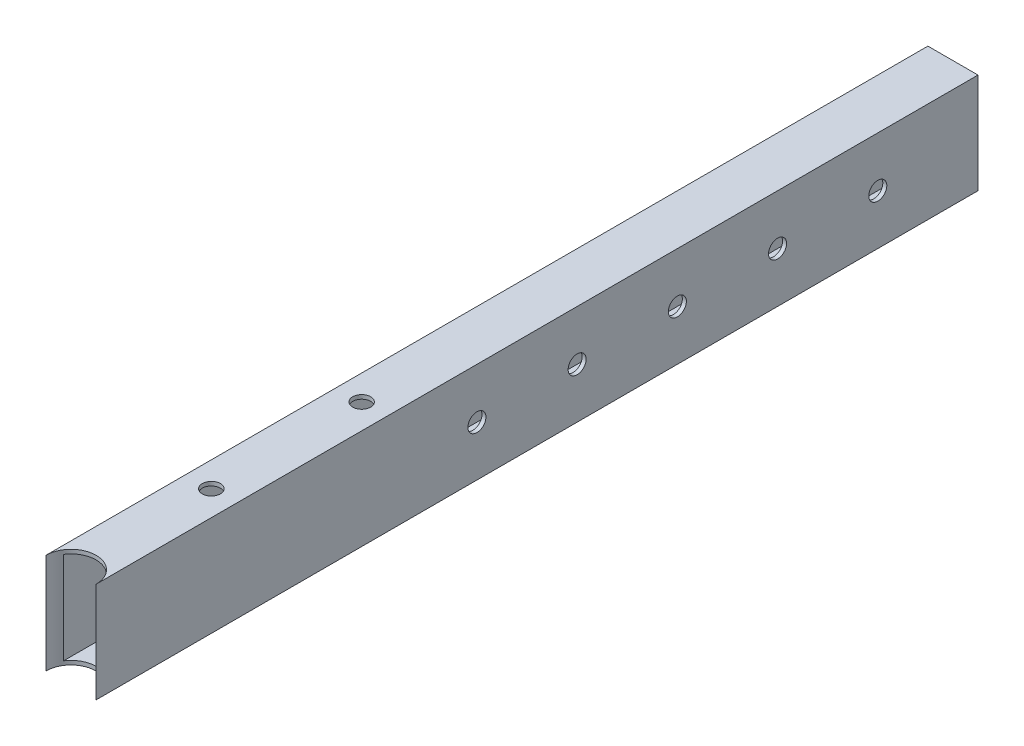
ISO-10303-21;
HEADER;
FILE_DESCRIPTION(('STEP AP214'),'2;1');
FILE_NAME('part.step','',(''),(''),'','','');
FILE_SCHEMA(('AUTOMOTIVE_DESIGN { 1 0 10303 214 1 1 1 1 }'));
ENDSEC;
DATA;
#1=APPLICATION_CONTEXT('core data for automotive mechanical design processes');
#2=APPLICATION_PROTOCOL_DEFINITION('international standard','automotive_design',2000,#1);
#3=PRODUCT_CONTEXT('',#1,'mechanical');
#4=PRODUCT('Part','Part','',(#3));
#5=PRODUCT_RELATED_PRODUCT_CATEGORY('part','',(#4));
#6=PRODUCT_DEFINITION_FORMATION('','',#4);
#7=PRODUCT_DEFINITION_CONTEXT('part definition',#1,'design');
#8=PRODUCT_DEFINITION('design','',#6,#7);
#9=PRODUCT_DEFINITION_SHAPE('','',#8);
#10=(LENGTH_UNIT() NAMED_UNIT(*) SI_UNIT(.MILLI.,.METRE.));
#11=(NAMED_UNIT(*) PLANE_ANGLE_UNIT() SI_UNIT($,.RADIAN.));
#12=(NAMED_UNIT(*) SI_UNIT($,.STERADIAN.) SOLID_ANGLE_UNIT());
#13=UNCERTAINTY_MEASURE_WITH_UNIT(LENGTH_MEASURE(1.E-05),#10,'distance_accuracy_value','');
#14=(GEOMETRIC_REPRESENTATION_CONTEXT(3) GLOBAL_UNCERTAINTY_ASSIGNED_CONTEXT((#13)) GLOBAL_UNIT_ASSIGNED_CONTEXT((#10,
#11,#12)) REPRESENTATION_CONTEXT('',''));
#15=CARTESIAN_POINT('',(0.,0.,0.));
#16=DIRECTION('',(0.,0.,1.));
#17=DIRECTION('',(1.,0.,0.));
#18=AXIS2_PLACEMENT_3D('',#15,#16,#17);
#19=CARTESIAN_POINT('',(0.,0.,0.));
#20=DIRECTION('',(0.,0.,1.));
#21=DIRECTION('',(1.,0.,0.));
#22=AXIS2_PLACEMENT_3D('',#19,#20,#21);
#23=PLANE('',#22);
#24=DIRECTION('',(0.,1.,0.));
#25=VECTOR('',#24,1.);
#26=CARTESIAN_POINT('',(12.5,25.,0.));
#27=LINE('',#26,#25);
#28=CARTESIAN_POINT('',(12.5,-25.,0.));
#29=VERTEX_POINT('',#28);
#30=CARTESIAN_POINT('',(12.5,25.,0.));
#31=VERTEX_POINT('',#30);
#32=EDGE_CURVE('E134',#29,#31,#27,.T.);
#33=ORIENTED_EDGE('',*,*,#32,.F.);
#34=DIRECTION('',(1.,0.,0.));
#35=VECTOR('',#34,1.);
#36=CARTESIAN_POINT('',(-12.5,-25.,0.));
#37=LINE('',#36,#35);
#38=CARTESIAN_POINT('',(-12.5,-25.,0.));
#39=VERTEX_POINT('',#38);
#40=EDGE_CURVE('E118',#39,#29,#37,.T.);
#41=ORIENTED_EDGE('',*,*,#40,.F.);
#42=DIRECTION('',(0.,-1.,0.));
#43=VECTOR('',#42,1.);
#44=CARTESIAN_POINT('',(-12.5,25.,0.));
#45=LINE('',#44,#43);
#46=CARTESIAN_POINT('',(-12.5,25.,0.));
#47=VERTEX_POINT('',#46);
#48=EDGE_CURVE('E128',#47,#39,#45,.T.);
#49=ORIENTED_EDGE('',*,*,#48,.F.);
#50=DIRECTION('',(-1.,0.,0.));
#51=VECTOR('',#50,1.);
#52=CARTESIAN_POINT('',(-12.5,25.,0.));
#53=LINE('',#52,#51);
#54=EDGE_CURVE('E136',#31,#47,#53,.T.);
#55=ORIENTED_EDGE('',*,*,#54,.F.);
#56=EDGE_LOOP('',(#33,#41,#49,#55));
#57=FACE_BOUND('',#56,.T.);
#58=DIRECTION('',(0.,1.,0.));
#59=VECTOR('',#58,1.);
#60=CARTESIAN_POINT('',(10.5,23.,0.));
#61=LINE('',#60,#59);
#62=CARTESIAN_POINT('',(10.5,-23.,0.));
#63=VERTEX_POINT('',#62);
#64=CARTESIAN_POINT('',(10.5,23.,0.));
#65=VERTEX_POINT('',#64);
#66=EDGE_CURVE('E167',#63,#65,#61,.T.);
#67=ORIENTED_EDGE('',*,*,#66,.T.);
#68=DIRECTION('',(-1.,0.,0.));
#69=VECTOR('',#68,1.);
#70=CARTESIAN_POINT('',(-10.5,23.,0.));
#71=LINE('',#70,#69);
#72=CARTESIAN_POINT('',(-10.5,23.,0.));
#73=VERTEX_POINT('',#72);
#74=EDGE_CURVE('E170',#65,#73,#71,.T.);
#75=ORIENTED_EDGE('',*,*,#74,.T.);
#76=DIRECTION('',(0.,-1.,0.));
#77=VECTOR('',#76,1.);
#78=CARTESIAN_POINT('',(-10.5,23.,0.));
#79=LINE('',#78,#77);
#80=CARTESIAN_POINT('',(-10.5,-23.,0.));
#81=VERTEX_POINT('',#80);
#82=EDGE_CURVE('E173',#73,#81,#79,.T.);
#83=ORIENTED_EDGE('',*,*,#82,.T.);
#84=DIRECTION('',(1.,0.,0.));
#85=VECTOR('',#84,1.);
#86=CARTESIAN_POINT('',(-10.5,-23.,0.));
#87=LINE('',#86,#85);
#88=EDGE_CURVE('E176',#81,#63,#87,.T.);
#89=ORIENTED_EDGE('',*,*,#88,.T.);
#90=EDGE_LOOP('',(#67,#75,#83,#89));
#91=FACE_BOUND('',#90,.T.);
#92=ADVANCED_FACE('F34',(#57,#91),#23,.F.);
#93=CARTESIAN_POINT('',(12.5,25.,440.));
#94=DIRECTION('',(-1.,0.,0.));
#95=DIRECTION('',(0.,-1.,0.));
#96=AXIS2_PLACEMENT_3D('',#93,#94,#95);
#97=PLANE('',#96);
#98=CARTESIAN_POINT('',(12.5,-1.95524016474513E-12,250.));
#99=DIRECTION('',(1.,0.,0.));
#100=DIRECTION('',(0.,1.,0.));
#101=AXIS2_PLACEMENT_3D('',#98,#99,#100);
#102=CIRCLE('',#101,4.50000000000002);
#103=CARTESIAN_POINT('',(12.5,4.49999999999807,250.));
#104=VERTEX_POINT('',#103);
#105=EDGE_CURVE('E275',#104,#104,#102,.T.);
#106=ORIENTED_EDGE('',*,*,#105,.F.);
#107=EDGE_LOOP('',(#106));
#108=FACE_BOUND('',#107,.T.);
#109=CARTESIAN_POINT('',(12.5,-1.9491169307494E-12,200.));
#110=DIRECTION('',(1.,0.,0.));
#111=DIRECTION('',(0.,1.,0.));
#112=AXIS2_PLACEMENT_3D('',#109,#110,#111);
#113=CIRCLE('',#112,4.50000000000002);
#114=CARTESIAN_POINT('',(12.5,4.49999999999807,200.));
#115=VERTEX_POINT('',#114);
#116=EDGE_CURVE('E277',#115,#115,#113,.T.);
#117=ORIENTED_EDGE('',*,*,#116,.F.);
#118=EDGE_LOOP('',(#117));
#119=FACE_BOUND('',#118,.T.);
#120=CARTESIAN_POINT('',(12.5,-1.94299369675366E-12,150.));
#121=DIRECTION('',(1.,0.,0.));
#122=DIRECTION('',(0.,1.,0.));
#123=AXIS2_PLACEMENT_3D('',#120,#121,#122);
#124=CIRCLE('',#123,4.49999999999999);
#125=CARTESIAN_POINT('',(12.5,4.49999999999805,150.));
#126=VERTEX_POINT('',#125);
#127=EDGE_CURVE('E283',#126,#126,#124,.T.);
#128=ORIENTED_EDGE('',*,*,#127,.F.);
#129=EDGE_LOOP('',(#128));
#130=FACE_BOUND('',#129,.T.);
#131=CARTESIAN_POINT('',(12.5,-1.93687046275792E-12,100.));
#132=DIRECTION('',(1.,0.,0.));
#133=DIRECTION('',(0.,1.,0.));
#134=AXIS2_PLACEMENT_3D('',#131,#132,#133);
#135=CIRCLE('',#134,4.5);
#136=CARTESIAN_POINT('',(12.5,4.49999999999807,100.));
#137=VERTEX_POINT('',#136);
#138=EDGE_CURVE('E289',#137,#137,#135,.T.);
#139=ORIENTED_EDGE('',*,*,#138,.F.);
#140=EDGE_LOOP('',(#139));
#141=FACE_BOUND('',#140,.T.);
#142=CARTESIAN_POINT('',(12.5,0.,50.));
#143=DIRECTION('',(1.,0.,0.));
#144=DIRECTION('',(0.,1.,0.));
#145=AXIS2_PLACEMENT_3D('',#142,#143,#144);
#146=CIRCLE('',#145,4.5);
#147=CARTESIAN_POINT('',(12.5,4.50000000000001,50.));
#148=VERTEX_POINT('',#147);
#149=EDGE_CURVE('E295',#148,#148,#146,.T.);
#150=ORIENTED_EDGE('',*,*,#149,.F.);
#151=EDGE_LOOP('',(#150));
#152=FACE_BOUND('',#151,.T.);
#153=ORIENTED_EDGE('',*,*,#32,.T.);
#154=DIRECTION('',(0.,0.,-1.));
#155=VECTOR('',#154,1.);
#156=CARTESIAN_POINT('',(12.5,25.,440.));
#157=LINE('',#156,#155);
#158=CARTESIAN_POINT('',(12.5,25.,440.));
#159=VERTEX_POINT('',#158);
#160=EDGE_CURVE('E43',#159,#31,#157,.T.);
#161=ORIENTED_EDGE('',*,*,#160,.F.);
#162=DIRECTION('',(0.,1.,0.));
#163=VECTOR('',#162,1.);
#164=CARTESIAN_POINT('',(12.5,25.,440.));
#165=LINE('',#164,#163);
#166=CARTESIAN_POINT('',(12.5,-25.,440.));
#167=VERTEX_POINT('',#166);
#168=EDGE_CURVE('E104',#167,#159,#165,.T.);
#169=ORIENTED_EDGE('',*,*,#168,.F.);
#170=DIRECTION('',(0.,0.,-1.));
#171=VECTOR('',#170,1.);
#172=CARTESIAN_POINT('',(12.5,-25.,440.));
#173=LINE('',#172,#171);
#174=EDGE_CURVE('E115',#167,#29,#173,.T.);
#175=ORIENTED_EDGE('',*,*,#174,.T.);
#176=EDGE_LOOP('',(#153,#161,#169,#175));
#177=FACE_BOUND('',#176,.T.);
#178=ADVANCED_FACE('F36',(#108,#119,#130,#141,#152,#177),#97,.F.);
#179=CARTESIAN_POINT('',(-12.5,25.,440.));
#180=DIRECTION('',(0.,-1.,0.));
#181=DIRECTION('',(0.,0.,-1.));
#182=AXIS2_PLACEMENT_3D('',#179,#180,#181);
#183=PLANE('',#182);
#184=CARTESIAN_POINT('',(0.,25.,295.));
#185=DIRECTION('',(0.,1.,0.));
#186=DIRECTION('',(0.,0.,1.));
#187=AXIS2_PLACEMENT_3D('',#184,#185,#186);
#188=CIRCLE('',#187,4.5);
#189=CARTESIAN_POINT('',(0.,25.,299.5));
#190=VERTEX_POINT('',#189);
#191=EDGE_CURVE('E232',#190,#190,#188,.T.);
#192=ORIENTED_EDGE('',*,*,#191,.F.);
#193=EDGE_LOOP('',(#192));
#194=FACE_BOUND('',#193,.T.);
#195=CARTESIAN_POINT('',(0.,25.,370.));
#196=DIRECTION('',(0.,1.,0.));
#197=DIRECTION('',(0.,0.,1.));
#198=AXIS2_PLACEMENT_3D('',#195,#196,#197);
#199=CIRCLE('',#198,4.5);
#200=CARTESIAN_POINT('',(0.,25.,374.5));
#201=VERTEX_POINT('',#200);
#202=EDGE_CURVE('E152',#201,#201,#199,.T.);
#203=ORIENTED_EDGE('',*,*,#202,.F.);
#204=EDGE_LOOP('',(#203));
#205=FACE_BOUND('',#204,.T.);
#206=DIRECTION('',(0.,0.,-1.));
#207=VECTOR('',#206,1.);
#208=CARTESIAN_POINT('',(-12.5,25.,440.));
#209=LINE('',#208,#207);
#210=CARTESIAN_POINT('',(-12.5,25.,440.));
#211=VERTEX_POINT('',#210);
#212=EDGE_CURVE('E140',#211,#47,#209,.T.);
#213=ORIENTED_EDGE('',*,*,#212,.F.);
#214=CARTESIAN_POINT('',(0.,25.,440.));
#215=DIRECTION('',(0.,1.,0.));
#216=DIRECTION('',(0.,0.,1.));
#217=AXIS2_PLACEMENT_3D('',#214,#215,#216);
#218=CIRCLE('',#217,12.5);
#219=EDGE_CURVE('E112',#159,#211,#218,.T.);
#220=ORIENTED_EDGE('',*,*,#219,.F.);
#221=ORIENTED_EDGE('',*,*,#160,.T.);
#222=ORIENTED_EDGE('',*,*,#54,.T.);
#223=EDGE_LOOP('',(#213,#220,#221,#222));
#224=FACE_BOUND('',#223,.T.);
#225=ADVANCED_FACE('F214',(#194,#205,#224),#183,.F.);
#226=CARTESIAN_POINT('',(-12.5,25.,440.));
#227=DIRECTION('',(1.,0.,0.));
#228=DIRECTION('',(0.,1.,0.));
#229=AXIS2_PLACEMENT_3D('',#226,#227,#228);
#230=PLANE('',#229);
#231=ORIENTED_EDGE('',*,*,#48,.T.);
#232=DIRECTION('',(0.,0.,-1.));
#233=VECTOR('',#232,1.);
#234=CARTESIAN_POINT('',(-12.5,-25.,440.));
#235=LINE('',#234,#233);
#236=CARTESIAN_POINT('',(-12.5,-25.,440.));
#237=VERTEX_POINT('',#236);
#238=EDGE_CURVE('E122',#237,#39,#235,.T.);
#239=ORIENTED_EDGE('',*,*,#238,.F.);
#240=DIRECTION('',(0.,-1.,0.));
#241=VECTOR('',#240,1.);
#242=CARTESIAN_POINT('',(-12.5,25.,440.));
#243=LINE('',#242,#241);
#244=EDGE_CURVE('E107',#211,#237,#243,.T.);
#245=ORIENTED_EDGE('',*,*,#244,.F.);
#246=ORIENTED_EDGE('',*,*,#212,.T.);
#247=EDGE_LOOP('',(#231,#239,#245,#246));
#248=FACE_BOUND('',#247,.T.);
#249=ADVANCED_FACE('F221',(#248),#230,.F.);
#250=CARTESIAN_POINT('',(-12.5,-25.,440.));
#251=DIRECTION('',(0.,1.,0.));
#252=DIRECTION('',(0.,0.,1.));
#253=AXIS2_PLACEMENT_3D('',#250,#251,#252);
#254=PLANE('',#253);
#255=CARTESIAN_POINT('',(0.,-25.,295.));
#256=DIRECTION('',(0.,1.,0.));
#257=DIRECTION('',(0.,0.,1.));
#258=AXIS2_PLACEMENT_3D('',#255,#256,#257);
#259=CIRCLE('',#258,4.5);
#260=CARTESIAN_POINT('',(0.,-25.,299.5));
#261=VERTEX_POINT('',#260);
#262=EDGE_CURVE('E303',#261,#261,#259,.T.);
#263=ORIENTED_EDGE('',*,*,#262,.T.);
#264=EDGE_LOOP('',(#263));
#265=FACE_BOUND('',#264,.T.);
#266=CARTESIAN_POINT('',(0.,-25.,370.));
#267=DIRECTION('',(0.,1.,0.));
#268=DIRECTION('',(0.,0.,1.));
#269=AXIS2_PLACEMENT_3D('',#266,#267,#268);
#270=CIRCLE('',#269,4.5);
#271=CARTESIAN_POINT('',(0.,-25.,374.5));
#272=VERTEX_POINT('',#271);
#273=EDGE_CURVE('E146',#272,#272,#270,.T.);
#274=ORIENTED_EDGE('',*,*,#273,.T.);
#275=EDGE_LOOP('',(#274));
#276=FACE_BOUND('',#275,.T.);
#277=ORIENTED_EDGE('',*,*,#174,.F.);
#278=CARTESIAN_POINT('',(0.,-25.,440.));
#279=DIRECTION('',(0.,1.,0.));
#280=DIRECTION('',(0.,0.,1.));
#281=AXIS2_PLACEMENT_3D('',#278,#279,#280);
#282=CIRCLE('',#281,12.5);
#283=EDGE_CURVE('E100',#167,#237,#282,.T.);
#284=ORIENTED_EDGE('',*,*,#283,.T.);
#285=ORIENTED_EDGE('',*,*,#238,.T.);
#286=ORIENTED_EDGE('',*,*,#40,.T.);
#287=EDGE_LOOP('',(#277,#284,#285,#286));
#288=FACE_BOUND('',#287,.T.);
#289=ADVANCED_FACE('F116',(#265,#276,#288),#254,.F.);
#290=CARTESIAN_POINT('',(10.5,23.,440.));
#291=DIRECTION('',(-1.,0.,0.));
#292=DIRECTION('',(0.,0.,1.));
#293=AXIS2_PLACEMENT_3D('',#290,#291,#292);
#294=PLANE('',#293);
#295=CARTESIAN_POINT('',(10.5,-1.95551772050129E-12,250.));
#296=DIRECTION('',(1.,0.,0.));
#297=DIRECTION('',(0.,1.,0.));
#298=AXIS2_PLACEMENT_3D('',#295,#296,#297);
#299=CIRCLE('',#298,4.50000000000002);
#300=CARTESIAN_POINT('',(10.5,4.49999999999806,250.));
#301=VERTEX_POINT('',#300);
#302=EDGE_CURVE('E272',#301,#301,#299,.T.);
#303=ORIENTED_EDGE('',*,*,#302,.T.);
#304=EDGE_LOOP('',(#303));
#305=FACE_BOUND('',#304,.T.);
#306=CARTESIAN_POINT('',(10.5,-1.94939448650555E-12,200.));
#307=DIRECTION('',(1.,0.,0.));
#308=DIRECTION('',(0.,1.,0.));
#309=AXIS2_PLACEMENT_3D('',#306,#307,#308);
#310=CIRCLE('',#309,4.50000000000002);
#311=CARTESIAN_POINT('',(10.5,4.49999999999807,200.));
#312=VERTEX_POINT('',#311);
#313=EDGE_CURVE('E280',#312,#312,#310,.T.);
#314=ORIENTED_EDGE('',*,*,#313,.T.);
#315=EDGE_LOOP('',(#314));
#316=FACE_BOUND('',#315,.T.);
#317=CARTESIAN_POINT('',(10.5,-1.94327125250982E-12,150.));
#318=DIRECTION('',(1.,0.,0.));
#319=DIRECTION('',(0.,1.,0.));
#320=AXIS2_PLACEMENT_3D('',#317,#318,#319);
#321=CIRCLE('',#320,4.49999999999999);
#322=CARTESIAN_POINT('',(10.5,4.49999999999805,150.));
#323=VERTEX_POINT('',#322);
#324=EDGE_CURVE('E286',#323,#323,#321,.T.);
#325=ORIENTED_EDGE('',*,*,#324,.T.);
#326=EDGE_LOOP('',(#325));
#327=FACE_BOUND('',#326,.T.);
#328=CARTESIAN_POINT('',(10.5,-1.93714801851408E-12,100.));
#329=DIRECTION('',(1.,0.,0.));
#330=DIRECTION('',(0.,1.,0.));
#331=AXIS2_PLACEMENT_3D('',#328,#329,#330);
#332=CIRCLE('',#331,4.5);
#333=CARTESIAN_POINT('',(10.5,4.49999999999807,100.));
#334=VERTEX_POINT('',#333);
#335=EDGE_CURVE('E292',#334,#334,#332,.T.);
#336=ORIENTED_EDGE('',*,*,#335,.T.);
#337=EDGE_LOOP('',(#336));
#338=FACE_BOUND('',#337,.T.);
#339=CARTESIAN_POINT('',(10.5,0.,50.));
#340=DIRECTION('',(1.,0.,0.));
#341=DIRECTION('',(0.,1.,0.));
#342=AXIS2_PLACEMENT_3D('',#339,#340,#341);
#343=CIRCLE('',#342,4.5);
#344=CARTESIAN_POINT('',(10.5,4.50000000000001,50.));
#345=VERTEX_POINT('',#344);
#346=EDGE_CURVE('E298',#345,#345,#343,.T.);
#347=ORIENTED_EDGE('',*,*,#346,.T.);
#348=EDGE_LOOP('',(#347));
#349=FACE_BOUND('',#348,.T.);
#350=DIRECTION('',(0.,1.,0.));
#351=VECTOR('',#350,1.);
#352=CARTESIAN_POINT('',(10.5,-25.,433.217670016875));
#353=LINE('',#352,#351);
#354=CARTESIAN_POINT('',(10.5,23.,433.217670016875));
#355=VERTEX_POINT('',#354);
#356=CARTESIAN_POINT('',(10.5,-23.,433.217670016875));
#357=VERTEX_POINT('',#356);
#358=EDGE_CURVE('E50',#355,#357,#353,.F.);
#359=ORIENTED_EDGE('',*,*,#358,.F.);
#360=DIRECTION('',(0.,0.,-1.));
#361=VECTOR('',#360,1.);
#362=CARTESIAN_POINT('',(10.5,23.,440.));
#363=LINE('',#362,#361);
#364=EDGE_CURVE('E131',#355,#65,#363,.T.);
#365=ORIENTED_EDGE('',*,*,#364,.T.);
#366=ORIENTED_EDGE('',*,*,#66,.F.);
#367=DIRECTION('',(0.,0.,-1.));
#368=VECTOR('',#367,1.);
#369=CARTESIAN_POINT('',(10.5,-23.,440.));
#370=LINE('',#369,#368);
#371=EDGE_CURVE('E57',#357,#63,#370,.T.);
#372=ORIENTED_EDGE('',*,*,#371,.F.);
#373=EDGE_LOOP('',(#359,#365,#366,#372));
#374=FACE_BOUND('',#373,.T.);
#375=ADVANCED_FACE('F189',(#305,#316,#327,#338,#349,#374),#294,.T.);
#376=CARTESIAN_POINT('',(-10.5,23.,440.));
#377=DIRECTION('',(0.,-1.,0.));
#378=DIRECTION('',(0.,0.,-1.));
#379=AXIS2_PLACEMENT_3D('',#376,#377,#378);
#380=PLANE('',#379);
#381=CARTESIAN_POINT('',(0.,23.,295.));
#382=DIRECTION('',(0.,-1.,0.));
#383=DIRECTION('',(0.,0.,-1.));
#384=AXIS2_PLACEMENT_3D('',#381,#382,#383);
#385=CIRCLE('',#384,4.5);
#386=CARTESIAN_POINT('',(0.,23.,290.5));
#387=VERTEX_POINT('',#386);
#388=EDGE_CURVE('E157',#387,#387,#385,.T.);
#389=ORIENTED_EDGE('',*,*,#388,.F.);
#390=EDGE_LOOP('',(#389));
#391=FACE_BOUND('',#390,.T.);
#392=CARTESIAN_POINT('',(0.,23.,370.));
#393=DIRECTION('',(0.,-1.,0.));
#394=DIRECTION('',(0.,0.,-1.));
#395=AXIS2_PLACEMENT_3D('',#392,#393,#394);
#396=CIRCLE('',#395,4.5);
#397=CARTESIAN_POINT('',(0.,23.,365.5));
#398=VERTEX_POINT('',#397);
#399=EDGE_CURVE('E145',#398,#398,#396,.T.);
#400=ORIENTED_EDGE('',*,*,#399,.F.);
#401=EDGE_LOOP('',(#400));
#402=FACE_BOUND('',#401,.T.);
#403=CARTESIAN_POINT('',(0.,23.,440.));
#404=DIRECTION('',(0.,-1.,0.));
#405=DIRECTION('',(0.,0.,-1.));
#406=AXIS2_PLACEMENT_3D('',#403,#404,#405);
#407=CIRCLE('',#406,12.5);
#408=CARTESIAN_POINT('',(-10.5,23.,433.217670016875));
#409=VERTEX_POINT('',#408);
#410=EDGE_CURVE('E164',#409,#355,#407,.T.);
#411=ORIENTED_EDGE('',*,*,#410,.F.);
#412=DIRECTION('',(0.,0.,-1.));
#413=VECTOR('',#412,1.);
#414=CARTESIAN_POINT('',(-10.5,23.,440.));
#415=LINE('',#414,#413);
#416=EDGE_CURVE('E181',#409,#73,#415,.T.);
#417=ORIENTED_EDGE('',*,*,#416,.T.);
#418=ORIENTED_EDGE('',*,*,#74,.F.);
#419=ORIENTED_EDGE('',*,*,#364,.F.);
#420=EDGE_LOOP('',(#411,#417,#418,#419));
#421=FACE_BOUND('',#420,.T.);
#422=ADVANCED_FACE('F190',(#391,#402,#421),#380,.T.);
#423=CARTESIAN_POINT('',(-10.5,23.,440.));
#424=DIRECTION('',(1.,0.,0.));
#425=DIRECTION('',(0.,0.,-1.));
#426=AXIS2_PLACEMENT_3D('',#423,#424,#425);
#427=PLANE('',#426);
#428=DIRECTION('',(0.,1.,0.));
#429=VECTOR('',#428,1.);
#430=CARTESIAN_POINT('',(-10.5,-25.,433.217670016875));
#431=LINE('',#430,#429);
#432=CARTESIAN_POINT('',(-10.5,-23.,433.217670016875));
#433=VERTEX_POINT('',#432);
#434=EDGE_CURVE('E111',#433,#409,#431,.T.);
#435=ORIENTED_EDGE('',*,*,#434,.F.);
#436=DIRECTION('',(0.,0.,-1.));
#437=VECTOR('',#436,1.);
#438=CARTESIAN_POINT('',(-10.5,-23.,440.));
#439=LINE('',#438,#437);
#440=EDGE_CURVE('E180',#433,#81,#439,.T.);
#441=ORIENTED_EDGE('',*,*,#440,.T.);
#442=ORIENTED_EDGE('',*,*,#82,.F.);
#443=ORIENTED_EDGE('',*,*,#416,.F.);
#444=EDGE_LOOP('',(#435,#441,#442,#443));
#445=FACE_BOUND('',#444,.T.);
#446=ADVANCED_FACE('F196',(#445),#427,.T.);
#447=CARTESIAN_POINT('',(-10.5,-23.,440.));
#448=DIRECTION('',(0.,1.,0.));
#449=DIRECTION('',(0.,0.,1.));
#450=AXIS2_PLACEMENT_3D('',#447,#448,#449);
#451=PLANE('',#450);
#452=CARTESIAN_POINT('',(0.,-23.,295.));
#453=DIRECTION('',(0.,1.,0.));
#454=DIRECTION('',(0.,0.,1.));
#455=AXIS2_PLACEMENT_3D('',#452,#453,#454);
#456=CIRCLE('',#455,4.5);
#457=CARTESIAN_POINT('',(0.,-23.,299.5));
#458=VERTEX_POINT('',#457);
#459=EDGE_CURVE('E38',#458,#458,#456,.T.);
#460=ORIENTED_EDGE('',*,*,#459,.F.);
#461=EDGE_LOOP('',(#460));
#462=FACE_BOUND('',#461,.T.);
#463=CARTESIAN_POINT('',(0.,-23.,370.));
#464=DIRECTION('',(0.,1.,0.));
#465=DIRECTION('',(0.,0.,1.));
#466=AXIS2_PLACEMENT_3D('',#463,#464,#465);
#467=CIRCLE('',#466,4.5);
#468=CARTESIAN_POINT('',(0.,-23.,374.5));
#469=VERTEX_POINT('',#468);
#470=EDGE_CURVE('E143',#469,#469,#467,.T.);
#471=ORIENTED_EDGE('',*,*,#470,.F.);
#472=EDGE_LOOP('',(#471));
#473=FACE_BOUND('',#472,.T.);
#474=CARTESIAN_POINT('',(0.,-23.,440.));
#475=DIRECTION('',(0.,1.,0.));
#476=DIRECTION('',(0.,0.,1.));
#477=AXIS2_PLACEMENT_3D('',#474,#475,#476);
#478=CIRCLE('',#477,12.5);
#479=EDGE_CURVE('E11',#357,#433,#478,.T.);
#480=ORIENTED_EDGE('',*,*,#479,.F.);
#481=ORIENTED_EDGE('',*,*,#371,.T.);
#482=ORIENTED_EDGE('',*,*,#88,.F.);
#483=ORIENTED_EDGE('',*,*,#440,.F.);
#484=EDGE_LOOP('',(#480,#481,#482,#483));
#485=FACE_BOUND('',#484,.T.);
#486=ADVANCED_FACE('F193',(#462,#473,#485),#451,.T.);
#487=CARTESIAN_POINT('',(0.,-25.,440.));
#488=DIRECTION('',(0.,1.,0.));
#489=DIRECTION('',(0.,0.,1.));
#490=AXIS2_PLACEMENT_3D('',#487,#488,#489);
#491=CYLINDRICAL_SURFACE('',#490,12.5);
#492=ORIENTED_EDGE('',*,*,#168,.T.);
#493=ORIENTED_EDGE('',*,*,#219,.T.);
#494=ORIENTED_EDGE('',*,*,#244,.T.);
#495=ORIENTED_EDGE('',*,*,#283,.F.);
#496=EDGE_LOOP('',(#492,#493,#494,#495));
#497=FACE_BOUND('',#496,.T.);
#498=ORIENTED_EDGE('',*,*,#358,.T.);
#499=ORIENTED_EDGE('',*,*,#479,.T.);
#500=ORIENTED_EDGE('',*,*,#434,.T.);
#501=ORIENTED_EDGE('',*,*,#410,.T.);
#502=EDGE_LOOP('',(#498,#499,#500,#501));
#503=FACE_BOUND('',#502,.T.);
#504=ADVANCED_FACE('F102',(#497,#503),#491,.F.);
#505=CARTESIAN_POINT('',(0.,-25.,370.));
#506=DIRECTION('',(0.,1.,0.));
#507=DIRECTION('',(0.,0.,1.));
#508=AXIS2_PLACEMENT_3D('',#505,#506,#507);
#509=CYLINDRICAL_SURFACE('',#508,4.5);
#510=ORIENTED_EDGE('',*,*,#470,.T.);
#511=EDGE_LOOP('',(#510));
#512=FACE_BOUND('',#511,.T.);
#513=ORIENTED_EDGE('',*,*,#273,.F.);
#514=EDGE_LOOP('',(#513));
#515=FACE_BOUND('',#514,.T.);
#516=ADVANCED_FACE('F198',(#512,#515),#509,.F.);
#517=ORIENTED_EDGE('',*,*,#399,.T.);
#518=EDGE_LOOP('',(#517));
#519=FACE_BOUND('',#518,.T.);
#520=ORIENTED_EDGE('',*,*,#202,.T.);
#521=EDGE_LOOP('',(#520));
#522=FACE_BOUND('',#521,.T.);
#523=ADVANCED_FACE('F204',(#519,#522),#509,.F.);
#524=CARTESIAN_POINT('',(0.,-25.,295.));
#525=DIRECTION('',(0.,1.,0.));
#526=DIRECTION('',(0.,0.,1.));
#527=AXIS2_PLACEMENT_3D('',#524,#525,#526);
#528=CYLINDRICAL_SURFACE('',#527,4.5);
#529=ORIENTED_EDGE('',*,*,#459,.T.);
#530=EDGE_LOOP('',(#529));
#531=FACE_BOUND('',#530,.T.);
#532=ORIENTED_EDGE('',*,*,#262,.F.);
#533=EDGE_LOOP('',(#532));
#534=FACE_BOUND('',#533,.T.);
#535=ADVANCED_FACE('F239',(#531,#534),#528,.F.);
#536=ORIENTED_EDGE('',*,*,#388,.T.);
#537=EDGE_LOOP('',(#536));
#538=FACE_BOUND('',#537,.T.);
#539=ORIENTED_EDGE('',*,*,#191,.T.);
#540=EDGE_LOOP('',(#539));
#541=FACE_BOUND('',#540,.T.);
#542=ADVANCED_FACE('F244',(#538,#541),#528,.F.);
#543=CARTESIAN_POINT('',(10.5,0.,50.));
#544=DIRECTION('',(1.,0.,0.));
#545=DIRECTION('',(0.,1.,0.));
#546=AXIS2_PLACEMENT_3D('',#543,#544,#545);
#547=CYLINDRICAL_SURFACE('',#546,4.5);
#548=ORIENTED_EDGE('',*,*,#346,.F.);
#549=EDGE_LOOP('',(#548));
#550=FACE_BOUND('',#549,.T.);
#551=ORIENTED_EDGE('',*,*,#149,.T.);
#552=EDGE_LOOP('',(#551));
#553=FACE_BOUND('',#552,.T.);
#554=ADVANCED_FACE('F248',(#550,#553),#547,.F.);
#555=CARTESIAN_POINT('',(10.5,-1.93714801851408E-12,100.));
#556=DIRECTION('',(1.,0.,0.));
#557=DIRECTION('',(0.,1.,0.));
#558=AXIS2_PLACEMENT_3D('',#555,#556,#557);
#559=CYLINDRICAL_SURFACE('',#558,4.5);
#560=ORIENTED_EDGE('',*,*,#335,.F.);
#561=EDGE_LOOP('',(#560));
#562=FACE_BOUND('',#561,.T.);
#563=ORIENTED_EDGE('',*,*,#138,.T.);
#564=EDGE_LOOP('',(#563));
#565=FACE_BOUND('',#564,.T.);
#566=ADVANCED_FACE('F251',(#562,#565),#559,.F.);
#567=CARTESIAN_POINT('',(10.5,-1.94327125250982E-12,150.));
#568=DIRECTION('',(1.,0.,0.));
#569=DIRECTION('',(0.,1.,0.));
#570=AXIS2_PLACEMENT_3D('',#567,#568,#569);
#571=CYLINDRICAL_SURFACE('',#570,4.49999999999999);
#572=ORIENTED_EDGE('',*,*,#324,.F.);
#573=EDGE_LOOP('',(#572));
#574=FACE_BOUND('',#573,.T.);
#575=ORIENTED_EDGE('',*,*,#127,.T.);
#576=EDGE_LOOP('',(#575));
#577=FACE_BOUND('',#576,.T.);
#578=ADVANCED_FACE('F255',(#574,#577),#571,.F.);
#579=CARTESIAN_POINT('',(10.5,-1.94939448650555E-12,200.));
#580=DIRECTION('',(1.,0.,0.));
#581=DIRECTION('',(0.,1.,0.));
#582=AXIS2_PLACEMENT_3D('',#579,#580,#581);
#583=CYLINDRICAL_SURFACE('',#582,4.50000000000002);
#584=ORIENTED_EDGE('',*,*,#313,.F.);
#585=EDGE_LOOP('',(#584));
#586=FACE_BOUND('',#585,.T.);
#587=ORIENTED_EDGE('',*,*,#116,.T.);
#588=EDGE_LOOP('',(#587));
#589=FACE_BOUND('',#588,.T.);
#590=ADVANCED_FACE('F259',(#586,#589),#583,.F.);
#591=CARTESIAN_POINT('',(10.5,-1.95551772050129E-12,250.));
#592=DIRECTION('',(1.,0.,0.));
#593=DIRECTION('',(0.,1.,0.));
#594=AXIS2_PLACEMENT_3D('',#591,#592,#593);
#595=CYLINDRICAL_SURFACE('',#594,4.50000000000002);
#596=ORIENTED_EDGE('',*,*,#302,.F.);
#597=EDGE_LOOP('',(#596));
#598=FACE_BOUND('',#597,.T.);
#599=ORIENTED_EDGE('',*,*,#105,.T.);
#600=EDGE_LOOP('',(#599));
#601=FACE_BOUND('',#600,.T.);
#602=ADVANCED_FACE('F263',(#598,#601),#595,.F.);
#603=CLOSED_SHELL('',(#92,#178,#225,#249,#289,#375,#422,#446,#486,#504,#516,#523,#535,#542,#554,
#566,#578,#590,#602));
#604=MANIFOLD_SOLID_BREP('B2',#603);
#605=ADVANCED_BREP_SHAPE_REPRESENTATION('',(#18,#604),#14);
#606=SHAPE_DEFINITION_REPRESENTATION(#9,#605);
ENDSEC;
END-ISO-10303-21;
